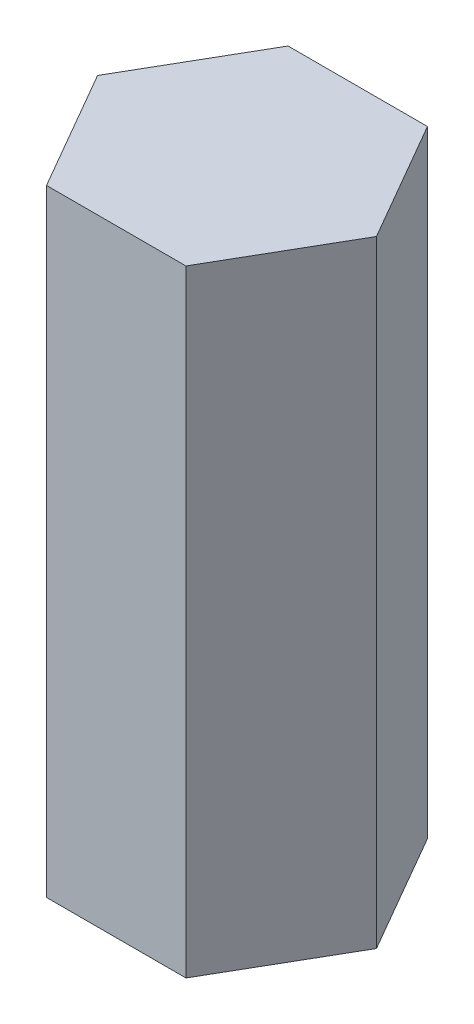
ISO-10303-21;
HEADER;
FILE_DESCRIPTION(('STEP AP214'),'2;1');
FILE_NAME('part.step','',(''),(''),'','','');
FILE_SCHEMA(('AUTOMOTIVE_DESIGN { 1 0 10303 214 1 1 1 1 }'));
ENDSEC;
DATA;
#1=APPLICATION_CONTEXT('core data for automotive mechanical design processes');
#2=APPLICATION_PROTOCOL_DEFINITION('international standard','automotive_design',2000,#1);
#3=PRODUCT_CONTEXT('',#1,'mechanical');
#4=PRODUCT('Part','Part','',(#3));
#5=PRODUCT_RELATED_PRODUCT_CATEGORY('part','',(#4));
#6=PRODUCT_DEFINITION_FORMATION('','',#4);
#7=PRODUCT_DEFINITION_CONTEXT('part definition',#1,'design');
#8=PRODUCT_DEFINITION('design','',#6,#7);
#9=PRODUCT_DEFINITION_SHAPE('','',#8);
#10=(LENGTH_UNIT() NAMED_UNIT(*) SI_UNIT(.MILLI.,.METRE.));
#11=(NAMED_UNIT(*) PLANE_ANGLE_UNIT() SI_UNIT($,.RADIAN.));
#12=(NAMED_UNIT(*) SI_UNIT($,.STERADIAN.) SOLID_ANGLE_UNIT());
#13=UNCERTAINTY_MEASURE_WITH_UNIT(LENGTH_MEASURE(1.E-05),#10,'distance_accuracy_value','');
#14=(GEOMETRIC_REPRESENTATION_CONTEXT(3) GLOBAL_UNCERTAINTY_ASSIGNED_CONTEXT((#13)) GLOBAL_UNIT_ASSIGNED_CONTEXT((#10,
#11,#12)) REPRESENTATION_CONTEXT('',''));
#15=CARTESIAN_POINT('',(0.,0.,0.));
#16=DIRECTION('',(0.,0.,1.));
#17=DIRECTION('',(1.,0.,0.));
#18=AXIS2_PLACEMENT_3D('',#15,#16,#17);
#19=CARTESIAN_POINT('',(1.35677313259564,12.,2.34999999999997));
#20=DIRECTION('',(-0.866025403784441,0.,-0.499999999999995));
#21=DIRECTION('',(-0.499999999999995,0.,0.866025403784442));
#22=AXIS2_PLACEMENT_3D('',#19,#20,#21);
#23=PLANE('',#22);
#24=DIRECTION('',(0.499999999999995,0.,-0.866025403784442));
#25=VECTOR('',#24,1.);
#26=CARTESIAN_POINT('',(1.35677313259564,0.,2.34999999999997));
#27=LINE('',#26,#25);
#28=CARTESIAN_POINT('',(1.35677313259564,0.,2.34999999999997));
#29=VERTEX_POINT('',#28);
#30=CARTESIAN_POINT('',(2.71354626519123,0.,0.));
#31=VERTEX_POINT('',#30);
#32=EDGE_CURVE('E127',#29,#31,#27,.T.);
#33=ORIENTED_EDGE('',*,*,#32,.T.);
#34=DIRECTION('',(0.,-1.,0.));
#35=VECTOR('',#34,1.);
#36=CARTESIAN_POINT('',(2.71354626519123,12.,0.));
#37=LINE('',#36,#35);
#38=CARTESIAN_POINT('',(2.71354626519123,12.,0.));
#39=VERTEX_POINT('',#38);
#40=EDGE_CURVE('E11',#39,#31,#37,.T.);
#41=ORIENTED_EDGE('',*,*,#40,.F.);
#42=DIRECTION('',(0.499999999999995,0.,-0.866025403784442));
#43=VECTOR('',#42,1.);
#44=CARTESIAN_POINT('',(1.35677313259564,12.,2.34999999999997));
#45=LINE('',#44,#43);
#46=CARTESIAN_POINT('',(1.35677313259564,12.,2.34999999999997));
#47=VERTEX_POINT('',#46);
#48=EDGE_CURVE('E137',#47,#39,#45,.T.);
#49=ORIENTED_EDGE('',*,*,#48,.F.);
#50=DIRECTION('',(0.,-1.,0.));
#51=VECTOR('',#50,1.);
#52=CARTESIAN_POINT('',(1.35677313259564,12.,2.34999999999997));
#53=LINE('',#52,#51);
#54=EDGE_CURVE('E123',#47,#29,#53,.T.);
#55=ORIENTED_EDGE('',*,*,#54,.T.);
#56=EDGE_LOOP('',(#33,#41,#49,#55));
#57=FACE_BOUND('',#56,.T.);
#58=ADVANCED_FACE('F43',(#57),#23,.F.);
#59=CARTESIAN_POINT('',(2.71354626519123,12.,0.));
#60=DIRECTION('',(-0.866025403784438,0.,0.500000000000001));
#61=DIRECTION('',(0.500000000000001,0.,0.866025403784438));
#62=AXIS2_PLACEMENT_3D('',#59,#60,#61);
#63=PLANE('',#62);
#64=DIRECTION('',(-0.500000000000001,0.,-0.866025403784438));
#65=VECTOR('',#64,1.);
#66=CARTESIAN_POINT('',(2.71354626519123,0.,0.));
#67=LINE('',#66,#65);
#68=CARTESIAN_POINT('',(1.35677313259561,0.,-2.34999999999999));
#69=VERTEX_POINT('',#68);
#70=EDGE_CURVE('E130',#31,#69,#67,.T.);
#71=ORIENTED_EDGE('',*,*,#70,.T.);
#72=DIRECTION('',(0.,-1.,0.));
#73=VECTOR('',#72,1.);
#74=CARTESIAN_POINT('',(1.35677313259561,12.,-2.34999999999999));
#75=LINE('',#74,#73);
#76=CARTESIAN_POINT('',(1.35677313259561,12.,-2.34999999999999));
#77=VERTEX_POINT('',#76);
#78=EDGE_CURVE('E51',#77,#69,#75,.T.);
#79=ORIENTED_EDGE('',*,*,#78,.F.);
#80=DIRECTION('',(-0.500000000000001,0.,-0.866025403784438));
#81=VECTOR('',#80,1.);
#82=CARTESIAN_POINT('',(2.71354626519123,12.,0.));
#83=LINE('',#82,#81);
#84=EDGE_CURVE('E96',#39,#77,#83,.T.);
#85=ORIENTED_EDGE('',*,*,#84,.F.);
#86=ORIENTED_EDGE('',*,*,#40,.T.);
#87=EDGE_LOOP('',(#71,#79,#85,#86));
#88=FACE_BOUND('',#87,.T.);
#89=ADVANCED_FACE('F161',(#88),#63,.F.);
#90=CARTESIAN_POINT('',(1.35677313259561,12.,-2.34999999999999));
#91=DIRECTION('',(0.,0.,1.));
#92=DIRECTION('',(1.,0.,0.));
#93=AXIS2_PLACEMENT_3D('',#90,#91,#92);
#94=PLANE('',#93);
#95=DIRECTION('',(-1.,0.,0.));
#96=VECTOR('',#95,1.);
#97=CARTESIAN_POINT('',(1.35677313259561,0.,-2.34999999999999));
#98=LINE('',#97,#96);
#99=CARTESIAN_POINT('',(-1.35677313259562,0.,-2.34999999999998));
#100=VERTEX_POINT('',#99);
#101=EDGE_CURVE('E132',#69,#100,#98,.T.);
#102=ORIENTED_EDGE('',*,*,#101,.T.);
#103=DIRECTION('',(0.,-1.,0.));
#104=VECTOR('',#103,1.);
#105=CARTESIAN_POINT('',(-1.35677313259562,12.,-2.34999999999998));
#106=LINE('',#105,#104);
#107=CARTESIAN_POINT('',(-1.35677313259562,12.,-2.34999999999998));
#108=VERTEX_POINT('',#107);
#109=EDGE_CURVE('E118',#108,#100,#106,.T.);
#110=ORIENTED_EDGE('',*,*,#109,.F.);
#111=DIRECTION('',(-1.,0.,0.));
#112=VECTOR('',#111,1.);
#113=CARTESIAN_POINT('',(1.35677313259561,12.,-2.34999999999999));
#114=LINE('',#113,#112);
#115=EDGE_CURVE('E109',#77,#108,#114,.T.);
#116=ORIENTED_EDGE('',*,*,#115,.F.);
#117=ORIENTED_EDGE('',*,*,#78,.T.);
#118=EDGE_LOOP('',(#102,#110,#116,#117));
#119=FACE_BOUND('',#118,.T.);
#120=ADVANCED_FACE('F143',(#119),#94,.F.);
#121=CARTESIAN_POINT('',(-1.35677313259562,12.,-2.34999999999998));
#122=DIRECTION('',(0.866025403784441,0.,0.499999999999995));
#123=DIRECTION('',(0.499999999999995,0.,-0.866025403784442));
#124=AXIS2_PLACEMENT_3D('',#121,#122,#123);
#125=PLANE('',#124);
#126=DIRECTION('',(-0.499999999999995,0.,0.866025403784441));
#127=VECTOR('',#126,1.);
#128=CARTESIAN_POINT('',(-1.35677313259562,0.,-2.34999999999998));
#129=LINE('',#128,#127);
#130=CARTESIAN_POINT('',(-2.71354626519123,0.,0.));
#131=VERTEX_POINT('',#130);
#132=EDGE_CURVE('E117',#100,#131,#129,.T.);
#133=ORIENTED_EDGE('',*,*,#132,.T.);
#134=DIRECTION('',(0.,-1.,0.));
#135=VECTOR('',#134,1.);
#136=CARTESIAN_POINT('',(-2.71354626519123,12.,0.));
#137=LINE('',#136,#135);
#138=CARTESIAN_POINT('',(-2.71354626519123,12.,0.));
#139=VERTEX_POINT('',#138);
#140=EDGE_CURVE('E114',#139,#131,#137,.T.);
#141=ORIENTED_EDGE('',*,*,#140,.F.);
#142=DIRECTION('',(-0.499999999999995,0.,0.866025403784441));
#143=VECTOR('',#142,1.);
#144=CARTESIAN_POINT('',(-1.35677313259562,12.,-2.34999999999998));
#145=LINE('',#144,#143);
#146=EDGE_CURVE('E103',#108,#139,#145,.T.);
#147=ORIENTED_EDGE('',*,*,#146,.F.);
#148=ORIENTED_EDGE('',*,*,#109,.T.);
#149=EDGE_LOOP('',(#133,#141,#147,#148));
#150=FACE_BOUND('',#149,.T.);
#151=ADVANCED_FACE('F115',(#150),#125,.F.);
#152=CARTESIAN_POINT('',(-2.71354626519123,12.,0.));
#153=DIRECTION('',(0.866025403784434,0.,-0.500000000000007));
#154=DIRECTION('',(-0.500000000000007,0.,-0.866025403784435));
#155=AXIS2_PLACEMENT_3D('',#152,#153,#154);
#156=PLANE('',#155);
#157=DIRECTION('',(0.500000000000007,0.,0.866025403784435));
#158=VECTOR('',#157,1.);
#159=CARTESIAN_POINT('',(-2.71354626519123,0.,0.));
#160=LINE('',#159,#158);
#161=CARTESIAN_POINT('',(-1.35677313259559,0.,2.35));
#162=VERTEX_POINT('',#161);
#163=EDGE_CURVE('E82',#131,#162,#160,.T.);
#164=ORIENTED_EDGE('',*,*,#163,.T.);
#165=DIRECTION('',(0.,-1.,0.));
#166=VECTOR('',#165,1.);
#167=CARTESIAN_POINT('',(-1.35677313259559,12.,2.35));
#168=LINE('',#167,#166);
#169=CARTESIAN_POINT('',(-1.35677313259559,12.,2.35));
#170=VERTEX_POINT('',#169);
#171=EDGE_CURVE('E119',#170,#162,#168,.T.);
#172=ORIENTED_EDGE('',*,*,#171,.F.);
#173=DIRECTION('',(0.500000000000007,0.,0.866025403784435));
#174=VECTOR('',#173,1.);
#175=CARTESIAN_POINT('',(-2.71354626519123,12.,0.));
#176=LINE('',#175,#174);
#177=EDGE_CURVE('E107',#139,#170,#176,.T.);
#178=ORIENTED_EDGE('',*,*,#177,.F.);
#179=ORIENTED_EDGE('',*,*,#140,.T.);
#180=EDGE_LOOP('',(#164,#172,#178,#179));
#181=FACE_BOUND('',#180,.T.);
#182=ADVANCED_FACE('F121',(#181),#156,.F.);
#183=CARTESIAN_POINT('',(-1.35677313259559,12.,2.35));
#184=DIRECTION('',(0.,0.,-1.));
#185=DIRECTION('',(-1.,0.,0.));
#186=AXIS2_PLACEMENT_3D('',#183,#184,#185);
#187=PLANE('',#186);
#188=DIRECTION('',(1.,0.,0.));
#189=VECTOR('',#188,1.);
#190=CARTESIAN_POINT('',(-1.35677313259559,0.,2.35));
#191=LINE('',#190,#189);
#192=EDGE_CURVE('E88',#162,#29,#191,.T.);
#193=ORIENTED_EDGE('',*,*,#192,.T.);
#194=ORIENTED_EDGE('',*,*,#54,.F.);
#195=DIRECTION('',(1.,0.,0.));
#196=VECTOR('',#195,1.);
#197=CARTESIAN_POINT('',(-1.35677313259559,12.,2.35));
#198=LINE('',#197,#196);
#199=EDGE_CURVE('E59',#170,#47,#198,.T.);
#200=ORIENTED_EDGE('',*,*,#199,.F.);
#201=ORIENTED_EDGE('',*,*,#171,.T.);
#202=EDGE_LOOP('',(#193,#194,#200,#201));
#203=FACE_BOUND('',#202,.T.);
#204=ADVANCED_FACE('F150',(#203),#187,.F.);
#205=CARTESIAN_POINT('',(0.,12.,0.));
#206=DIRECTION('',(0.,1.,0.));
#207=DIRECTION('',(0.,0.,1.));
#208=AXIS2_PLACEMENT_3D('',#205,#206,#207);
#209=PLANE('',#208);
#210=ORIENTED_EDGE('',*,*,#48,.T.);
#211=ORIENTED_EDGE('',*,*,#84,.T.);
#212=ORIENTED_EDGE('',*,*,#115,.T.);
#213=ORIENTED_EDGE('',*,*,#146,.T.);
#214=ORIENTED_EDGE('',*,*,#177,.T.);
#215=ORIENTED_EDGE('',*,*,#199,.T.);
#216=EDGE_LOOP('',(#210,#211,#212,#213,#214,#215));
#217=FACE_BOUND('',#216,.T.);
#218=ADVANCED_FACE('F105',(#217),#209,.T.);
#219=CARTESIAN_POINT('',(0.,0.,0.));
#220=DIRECTION('',(0.,1.,0.));
#221=DIRECTION('',(0.,0.,1.));
#222=AXIS2_PLACEMENT_3D('',#219,#220,#221);
#223=PLANE('',#222);
#224=ORIENTED_EDGE('',*,*,#32,.F.);
#225=ORIENTED_EDGE('',*,*,#192,.F.);
#226=ORIENTED_EDGE('',*,*,#163,.F.);
#227=ORIENTED_EDGE('',*,*,#132,.F.);
#228=ORIENTED_EDGE('',*,*,#101,.F.);
#229=ORIENTED_EDGE('',*,*,#70,.F.);
#230=EDGE_LOOP('',(#224,#225,#226,#227,#228,#229));
#231=FACE_BOUND('',#230,.T.);
#232=ADVANCED_FACE('F146',(#231),#223,.F.);
#233=CLOSED_SHELL('',(#58,#89,#120,#151,#182,#204,#218,#232));
#234=MANIFOLD_SOLID_BREP('B2',#233);
#235=ADVANCED_BREP_SHAPE_REPRESENTATION('',(#18,#234),#14);
#236=SHAPE_DEFINITION_REPRESENTATION(#9,#235);
ENDSEC;
END-ISO-10303-21;
